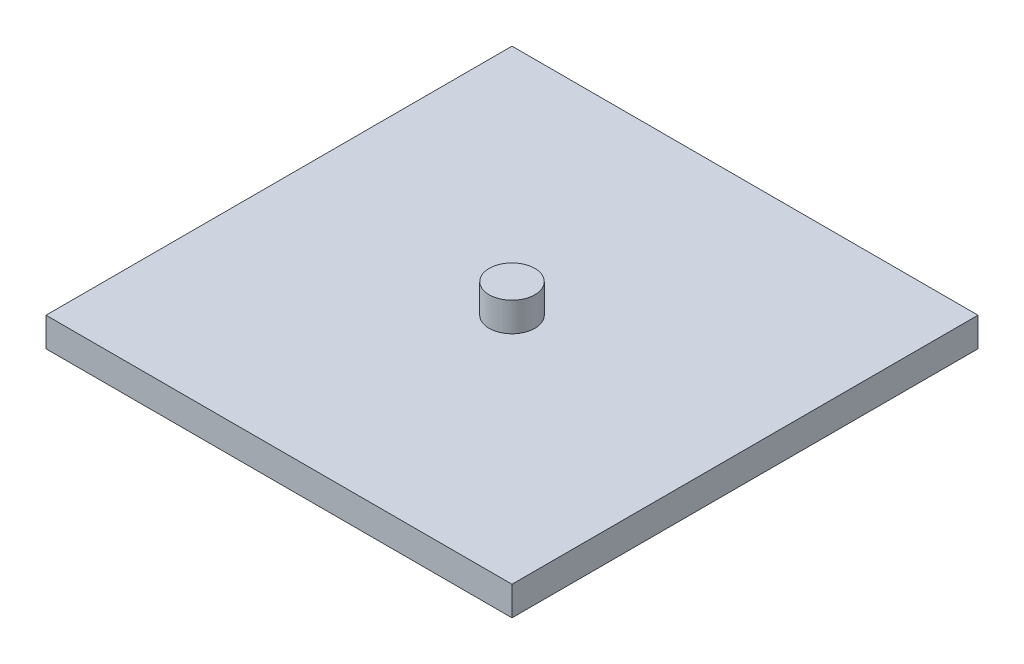
ISO-10303-21;
HEADER;
FILE_DESCRIPTION(('STEP AP214'),'2;1');
FILE_NAME('part.step','',(''),(''),'','','');
FILE_SCHEMA(('AUTOMOTIVE_DESIGN { 1 0 10303 214 1 1 1 1 }'));
ENDSEC;
DATA;
#1=APPLICATION_CONTEXT('core data for automotive mechanical design processes');
#2=APPLICATION_PROTOCOL_DEFINITION('international standard','automotive_design',2000,#1);
#3=PRODUCT_CONTEXT('',#1,'mechanical');
#4=PRODUCT('Part','Part','',(#3));
#5=PRODUCT_RELATED_PRODUCT_CATEGORY('part','',(#4));
#6=PRODUCT_DEFINITION_FORMATION('','',#4);
#7=PRODUCT_DEFINITION_CONTEXT('part definition',#1,'design');
#8=PRODUCT_DEFINITION('design','',#6,#7);
#9=PRODUCT_DEFINITION_SHAPE('','',#8);
#10=(LENGTH_UNIT() NAMED_UNIT(*) SI_UNIT(.MILLI.,.METRE.));
#11=(NAMED_UNIT(*) PLANE_ANGLE_UNIT() SI_UNIT($,.RADIAN.));
#12=(NAMED_UNIT(*) SI_UNIT($,.STERADIAN.) SOLID_ANGLE_UNIT());
#13=UNCERTAINTY_MEASURE_WITH_UNIT(LENGTH_MEASURE(1.E-05),#10,'distance_accuracy_value','');
#14=(GEOMETRIC_REPRESENTATION_CONTEXT(3) GLOBAL_UNCERTAINTY_ASSIGNED_CONTEXT((#13)) GLOBAL_UNIT_ASSIGNED_CONTEXT((#10,
#11,#12)) REPRESENTATION_CONTEXT('',''));
#15=CARTESIAN_POINT('',(0.,0.,0.));
#16=DIRECTION('',(0.,0.,1.));
#17=DIRECTION('',(1.,0.,0.));
#18=AXIS2_PLACEMENT_3D('',#15,#16,#17);
#19=CARTESIAN_POINT('',(-98.4954,-12.6671393030818,0.));
#20=DIRECTION('',(0.,-1.,0.));
#21=DIRECTION('',(0.,0.,-1.));
#22=AXIS2_PLACEMENT_3D('',#19,#20,#21);
#23=CYLINDRICAL_SURFACE('',#22,2.4892);
#24=CARTESIAN_POINT('',(-98.4954,-22.882660102,0.));
#25=DIRECTION('',(0.,1.,0.));
#26=DIRECTION('',(0.,0.,1.));
#27=AXIS2_PLACEMENT_3D('',#24,#25,#26);
#28=CIRCLE('',#27,2.4892);
#29=CARTESIAN_POINT('',(-98.4954,-22.882660102,2.4892));
#30=VERTEX_POINT('',#29);
#31=EDGE_CURVE('E43',#30,#30,#28,.T.);
#32=ORIENTED_EDGE('',*,*,#31,.T.);
#33=EDGE_LOOP('',(#32));
#34=FACE_BOUND('',#33,.T.);
#35=CARTESIAN_POINT('',(-98.4954,-19.707660102,0.));
#36=DIRECTION('',(0.,1.,0.));
#37=DIRECTION('',(0.,0.,1.));
#38=AXIS2_PLACEMENT_3D('',#35,#36,#37);
#39=CIRCLE('',#38,2.4892);
#40=CARTESIAN_POINT('',(-98.4954,-19.707660102,2.4892));
#41=VERTEX_POINT('',#40);
#42=EDGE_CURVE('E11',#41,#41,#39,.T.);
#43=ORIENTED_EDGE('',*,*,#42,.F.);
#44=EDGE_LOOP('',(#43));
#45=FACE_BOUND('',#44,.T.);
#46=ADVANCED_FACE('F39',(#34,#45),#23,.T.);
#47=CARTESIAN_POINT('',(0.,-19.707660102,0.));
#48=DIRECTION('',(0.,1.,0.));
#49=DIRECTION('',(0.,0.,1.));
#50=AXIS2_PLACEMENT_3D('',#47,#48,#49);
#51=PLANE('',#50);
#52=ORIENTED_EDGE('',*,*,#42,.T.);
#53=EDGE_LOOP('',(#52));
#54=FACE_BOUND('',#53,.T.);
#55=ADVANCED_FACE('F41',(#54),#51,.T.);
#56=CARTESIAN_POINT('',(-123.8954,48.9593888665533,-25.4));
#57=DIRECTION('',(1.,0.,0.));
#58=DIRECTION('',(0.,0.,-1.));
#59=AXIS2_PLACEMENT_3D('',#56,#57,#58);
#60=PLANE('',#59);
#61=DIRECTION('',(0.,0.,1.));
#62=VECTOR('',#61,1.);
#63=CARTESIAN_POINT('',(-123.8954,-22.882660102,-25.4));
#64=LINE('',#63,#62);
#65=CARTESIAN_POINT('',(-123.8954,-22.882660102,-25.4));
#66=VERTEX_POINT('',#65);
#67=CARTESIAN_POINT('',(-123.8954,-22.882660102,25.4));
#68=VERTEX_POINT('',#67);
#69=EDGE_CURVE('E90',#66,#68,#64,.T.);
#70=ORIENTED_EDGE('',*,*,#69,.F.);
#71=DIRECTION('',(0.,-1.,0.));
#72=VECTOR('',#71,1.);
#73=CARTESIAN_POINT('',(-123.8954,48.9593888665533,-25.4));
#74=LINE('',#73,#72);
#75=CARTESIAN_POINT('',(-123.8954,-26.057660102,-25.4));
#76=VERTEX_POINT('',#75);
#77=EDGE_CURVE('E54',#66,#76,#74,.T.);
#78=ORIENTED_EDGE('',*,*,#77,.T.);
#79=DIRECTION('',(0.,0.,1.));
#80=VECTOR('',#79,1.);
#81=CARTESIAN_POINT('',(-123.8954,-26.057660102,-25.4));
#82=LINE('',#81,#80);
#83=CARTESIAN_POINT('',(-123.8954,-26.057660102,25.4));
#84=VERTEX_POINT('',#83);
#85=EDGE_CURVE('E88',#76,#84,#82,.T.);
#86=ORIENTED_EDGE('',*,*,#85,.T.);
#87=DIRECTION('',(0.,-1.,0.));
#88=VECTOR('',#87,1.);
#89=CARTESIAN_POINT('',(-123.8954,48.9593888665533,25.4));
#90=LINE('',#89,#88);
#91=EDGE_CURVE('E77',#68,#84,#90,.T.);
#92=ORIENTED_EDGE('',*,*,#91,.F.);
#93=EDGE_LOOP('',(#70,#78,#86,#92));
#94=FACE_BOUND('',#93,.T.);
#95=ADVANCED_FACE('F86',(#94),#60,.F.);
#96=CARTESIAN_POINT('',(-123.8954,48.9593888665533,25.4));
#97=DIRECTION('',(0.,0.,-1.));
#98=DIRECTION('',(-1.,0.,0.));
#99=AXIS2_PLACEMENT_3D('',#96,#97,#98);
#100=PLANE('',#99);
#101=DIRECTION('',(1.,0.,0.));
#102=VECTOR('',#101,1.);
#103=CARTESIAN_POINT('',(-123.8954,-22.882660102,25.4));
#104=LINE('',#103,#102);
#105=CARTESIAN_POINT('',(-73.0954,-22.882660102,25.4));
#106=VERTEX_POINT('',#105);
#107=EDGE_CURVE('E83',#68,#106,#104,.T.);
#108=ORIENTED_EDGE('',*,*,#107,.F.);
#109=ORIENTED_EDGE('',*,*,#91,.T.);
#110=DIRECTION('',(1.,0.,0.));
#111=VECTOR('',#110,1.);
#112=CARTESIAN_POINT('',(-123.8954,-26.057660102,25.4));
#113=LINE('',#112,#111);
#114=CARTESIAN_POINT('',(-73.0954,-26.057660102,25.4));
#115=VERTEX_POINT('',#114);
#116=EDGE_CURVE('E101',#84,#115,#113,.T.);
#117=ORIENTED_EDGE('',*,*,#116,.T.);
#118=DIRECTION('',(0.,-1.,0.));
#119=VECTOR('',#118,1.);
#120=CARTESIAN_POINT('',(-73.0954,48.9593888665533,25.4));
#121=LINE('',#120,#119);
#122=EDGE_CURVE('E113',#106,#115,#121,.T.);
#123=ORIENTED_EDGE('',*,*,#122,.F.);
#124=EDGE_LOOP('',(#108,#109,#117,#123));
#125=FACE_BOUND('',#124,.T.);
#126=ADVANCED_FACE('F118',(#125),#100,.F.);
#127=CARTESIAN_POINT('',(-73.0954,48.9593888665533,-25.4));
#128=DIRECTION('',(-1.,0.,0.));
#129=DIRECTION('',(0.,0.,1.));
#130=AXIS2_PLACEMENT_3D('',#127,#128,#129);
#131=PLANE('',#130);
#132=DIRECTION('',(0.,0.,-1.));
#133=VECTOR('',#132,1.);
#134=CARTESIAN_POINT('',(-73.0954,-22.882660102,-25.4));
#135=LINE('',#134,#133);
#136=CARTESIAN_POINT('',(-73.0954,-22.882660102,-25.4));
#137=VERTEX_POINT('',#136);
#138=EDGE_CURVE('E107',#106,#137,#135,.T.);
#139=ORIENTED_EDGE('',*,*,#138,.F.);
#140=ORIENTED_EDGE('',*,*,#122,.T.);
#141=DIRECTION('',(0.,0.,-1.));
#142=VECTOR('',#141,1.);
#143=CARTESIAN_POINT('',(-73.0954,-26.057660102,-25.4));
#144=LINE('',#143,#142);
#145=CARTESIAN_POINT('',(-73.0954,-26.057660102,-25.4));
#146=VERTEX_POINT('',#145);
#147=EDGE_CURVE('E115',#115,#146,#144,.T.);
#148=ORIENTED_EDGE('',*,*,#147,.T.);
#149=DIRECTION('',(0.,-1.,0.));
#150=VECTOR('',#149,1.);
#151=CARTESIAN_POINT('',(-73.0954,48.9593888665533,-25.4));
#152=LINE('',#151,#150);
#153=EDGE_CURVE('E60',#137,#146,#152,.T.);
#154=ORIENTED_EDGE('',*,*,#153,.F.);
#155=EDGE_LOOP('',(#139,#140,#148,#154));
#156=FACE_BOUND('',#155,.T.);
#157=ADVANCED_FACE('F117',(#156),#131,.F.);
#158=CARTESIAN_POINT('',(-123.8954,48.9593888665533,-25.4));
#159=DIRECTION('',(0.,0.,1.));
#160=DIRECTION('',(1.,0.,0.));
#161=AXIS2_PLACEMENT_3D('',#158,#159,#160);
#162=PLANE('',#161);
#163=DIRECTION('',(-1.,0.,0.));
#164=VECTOR('',#163,1.);
#165=CARTESIAN_POINT('',(-123.8954,-22.882660102,-25.4));
#166=LINE('',#165,#164);
#167=EDGE_CURVE('E98',#137,#66,#166,.T.);
#168=ORIENTED_EDGE('',*,*,#167,.F.);
#169=ORIENTED_EDGE('',*,*,#153,.T.);
#170=DIRECTION('',(-1.,0.,0.));
#171=VECTOR('',#170,1.);
#172=CARTESIAN_POINT('',(-123.8954,-26.057660102,-25.4));
#173=LINE('',#172,#171);
#174=EDGE_CURVE('E94',#146,#76,#173,.T.);
#175=ORIENTED_EDGE('',*,*,#174,.T.);
#176=ORIENTED_EDGE('',*,*,#77,.F.);
#177=EDGE_LOOP('',(#168,#169,#175,#176));
#178=FACE_BOUND('',#177,.T.);
#179=ADVANCED_FACE('F95',(#178),#162,.F.);
#180=CARTESIAN_POINT('',(0.,-22.882660102,0.));
#181=DIRECTION('',(0.,1.,0.));
#182=DIRECTION('',(0.,0.,1.));
#183=AXIS2_PLACEMENT_3D('',#180,#181,#182);
#184=PLANE('',#183);
#185=ORIENTED_EDGE('',*,*,#31,.F.);
#186=EDGE_LOOP('',(#185));
#187=FACE_BOUND('',#186,.T.);
#188=ORIENTED_EDGE('',*,*,#167,.T.);
#189=ORIENTED_EDGE('',*,*,#69,.T.);
#190=ORIENTED_EDGE('',*,*,#107,.T.);
#191=ORIENTED_EDGE('',*,*,#138,.T.);
#192=EDGE_LOOP('',(#188,#189,#190,#191));
#193=FACE_BOUND('',#192,.T.);
#194=ADVANCED_FACE('F138',(#187,#193),#184,.T.);
#195=CARTESIAN_POINT('',(-98.4954,-26.057660102,0.));
#196=DIRECTION('',(0.,1.,0.));
#197=DIRECTION('',(0.,0.,1.));
#198=AXIS2_PLACEMENT_3D('',#195,#196,#197);
#199=PLANE('',#198);
#200=ORIENTED_EDGE('',*,*,#85,.F.);
#201=ORIENTED_EDGE('',*,*,#174,.F.);
#202=ORIENTED_EDGE('',*,*,#147,.F.);
#203=ORIENTED_EDGE('',*,*,#116,.F.);
#204=EDGE_LOOP('',(#200,#201,#202,#203));
#205=FACE_BOUND('',#204,.T.);
#206=ADVANCED_FACE('F100',(#205),#199,.F.);
#207=CLOSED_SHELL('',(#46,#55,#95,#126,#157,#179,#194,#206));
#208=MANIFOLD_SOLID_BREP('B2',#207);
#209=ADVANCED_BREP_SHAPE_REPRESENTATION('',(#18,#208),#14);
#210=SHAPE_DEFINITION_REPRESENTATION(#9,#209);
ENDSEC;
END-ISO-10303-21;
